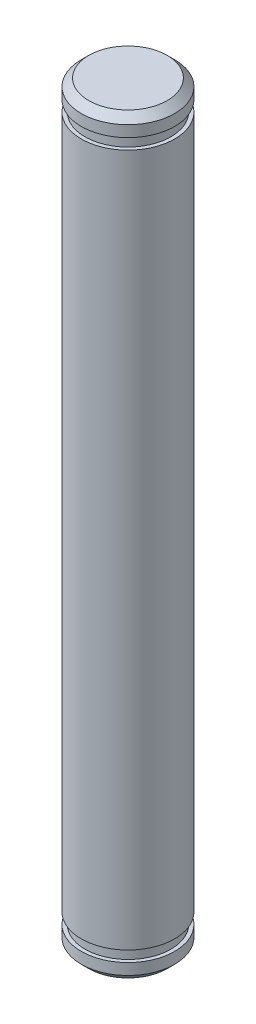
ISO-10303-21;
HEADER;
FILE_DESCRIPTION(('STEP AP214'),'2;1');
FILE_NAME('part.step','',(''),(''),'','','');
FILE_SCHEMA(('AUTOMOTIVE_DESIGN { 1 0 10303 214 1 1 1 1 }'));
ENDSEC;
DATA;
#1=APPLICATION_CONTEXT('core data for automotive mechanical design processes');
#2=APPLICATION_PROTOCOL_DEFINITION('international standard','automotive_design',2000,#1);
#3=PRODUCT_CONTEXT('',#1,'mechanical');
#4=PRODUCT('Part','Part','',(#3));
#5=PRODUCT_RELATED_PRODUCT_CATEGORY('part','',(#4));
#6=PRODUCT_DEFINITION_FORMATION('','',#4);
#7=PRODUCT_DEFINITION_CONTEXT('part definition',#1,'design');
#8=PRODUCT_DEFINITION('design','',#6,#7);
#9=PRODUCT_DEFINITION_SHAPE('','',#8);
#10=(LENGTH_UNIT() NAMED_UNIT(*) SI_UNIT(.MILLI.,.METRE.));
#11=(NAMED_UNIT(*) PLANE_ANGLE_UNIT() SI_UNIT($,.RADIAN.));
#12=(NAMED_UNIT(*) SI_UNIT($,.STERADIAN.) SOLID_ANGLE_UNIT());
#13=UNCERTAINTY_MEASURE_WITH_UNIT(LENGTH_MEASURE(1.E-05),#10,'distance_accuracy_value','');
#14=(GEOMETRIC_REPRESENTATION_CONTEXT(3) GLOBAL_UNCERTAINTY_ASSIGNED_CONTEXT((#13)) GLOBAL_UNIT_ASSIGNED_CONTEXT((#10,
#11,#12)) REPRESENTATION_CONTEXT('',''));
#15=CARTESIAN_POINT('',(0.,0.,0.));
#16=DIRECTION('',(0.,0.,1.));
#17=DIRECTION('',(1.,0.,0.));
#18=AXIS2_PLACEMENT_3D('',#15,#16,#17);
#19=CARTESIAN_POINT('',(0.,-25.5651,0.));
#20=DIRECTION('',(0.,-1.,0.));
#21=DIRECTION('',(1.,0.,0.));
#22=AXIS2_PLACEMENT_3D('',#19,#20,#21);
#23=PLANE('',#22);
#24=CARTESIAN_POINT('',(0.,-25.5651,0.));
#25=DIRECTION('',(0.,-1.,0.));
#26=DIRECTION('',(1.,0.,0.));
#27=AXIS2_PLACEMENT_3D('',#24,#25,#26);
#28=CIRCLE('',#27,2.66699999999997);
#29=CARTESIAN_POINT('',(2.66699999999995,-25.5651,0.));
#30=VERTEX_POINT('',#29);
#31=EDGE_CURVE('E56',#30,#30,#28,.T.);
#32=ORIENTED_EDGE('',*,*,#31,.T.);
#33=EDGE_LOOP('',(#32));
#34=FACE_BOUND('',#33,.T.);
#35=ADVANCED_FACE('F45',(#34),#23,.T.);
#36=CARTESIAN_POINT('',(0.,25.5651,0.));
#37=DIRECTION('',(0.,1.,0.));
#38=DIRECTION('',(-1.,0.,0.));
#39=AXIS2_PLACEMENT_3D('',#36,#37,#38);
#40=CYLINDRICAL_SURFACE('',#39,3.17499999999997);
#41=CARTESIAN_POINT('',(0.,-25.0571,0.));
#42=DIRECTION('',(0.,-1.,0.));
#43=DIRECTION('',(1.,0.,0.));
#44=AXIS2_PLACEMENT_3D('',#41,#42,#43);
#45=CIRCLE('',#44,3.17499999999997);
#46=CARTESIAN_POINT('',(3.17499999999995,-25.0571,0.));
#47=VERTEX_POINT('',#46);
#48=EDGE_CURVE('E60',#47,#47,#45,.F.);
#49=ORIENTED_EDGE('',*,*,#48,.T.);
#50=EDGE_LOOP('',(#49));
#51=FACE_BOUND('',#50,.T.);
#52=CARTESIAN_POINT('',(0.,-24.2951,0.));
#53=DIRECTION('',(0.,1.,0.));
#54=DIRECTION('',(-1.,0.,0.));
#55=AXIS2_PLACEMENT_3D('',#52,#53,#54);
#56=CIRCLE('',#55,3.17499999999997);
#57=CARTESIAN_POINT('',(-3.17499999999999,-24.2951,0.));
#58=VERTEX_POINT('',#57);
#59=EDGE_CURVE('E65',#58,#58,#56,.T.);
#60=ORIENTED_EDGE('',*,*,#59,.F.);
#61=EDGE_LOOP('',(#60));
#62=FACE_BOUND('',#61,.T.);
#63=ADVANCED_FACE('F107',(#51,#62),#40,.T.);
#64=CARTESIAN_POINT('',(-3.17499999999999,-24.2951,0.));
#65=DIRECTION('',(0.,1.,0.));
#66=DIRECTION('',(-1.,0.,0.));
#67=AXIS2_PLACEMENT_3D('',#64,#65,#66);
#68=PLANE('',#67);
#69=ORIENTED_EDGE('',*,*,#59,.T.);
#70=EDGE_LOOP('',(#69));
#71=FACE_BOUND('',#70,.T.);
#72=CARTESIAN_POINT('',(0.,-24.2951,0.));
#73=DIRECTION('',(0.,1.,0.));
#74=DIRECTION('',(-1.,0.,0.));
#75=AXIS2_PLACEMENT_3D('',#72,#73,#74);
#76=CIRCLE('',#75,2.92099999999997);
#77=CARTESIAN_POINT('',(-2.92099999999999,-24.2951,0.));
#78=VERTEX_POINT('',#77);
#79=EDGE_CURVE('E68',#78,#78,#76,.T.);
#80=ORIENTED_EDGE('',*,*,#79,.F.);
#81=EDGE_LOOP('',(#80));
#82=FACE_BOUND('',#81,.T.);
#83=ADVANCED_FACE('F113',(#71,#82),#68,.T.);
#84=CARTESIAN_POINT('',(0.,25.5651,0.));
#85=DIRECTION('',(0.,1.,0.));
#86=DIRECTION('',(-1.,0.,0.));
#87=AXIS2_PLACEMENT_3D('',#84,#85,#86);
#88=CYLINDRICAL_SURFACE('',#87,2.92099999999997);
#89=ORIENTED_EDGE('',*,*,#79,.T.);
#90=EDGE_LOOP('',(#89));
#91=FACE_BOUND('',#90,.T.);
#92=CARTESIAN_POINT('',(0.,-23.5585,0.));
#93=DIRECTION('',(0.,1.,0.));
#94=DIRECTION('',(-1.,0.,0.));
#95=AXIS2_PLACEMENT_3D('',#92,#93,#94);
#96=CIRCLE('',#95,2.92099999999997);
#97=CARTESIAN_POINT('',(-2.92099999999999,-23.5585,0.));
#98=VERTEX_POINT('',#97);
#99=EDGE_CURVE('E71',#98,#98,#96,.T.);
#100=ORIENTED_EDGE('',*,*,#99,.F.);
#101=EDGE_LOOP('',(#100));
#102=FACE_BOUND('',#101,.T.);
#103=ADVANCED_FACE('F134',(#91,#102),#88,.T.);
#104=CARTESIAN_POINT('',(-3.175,-23.5585,0.));
#105=DIRECTION('',(0.,-1.,0.));
#106=DIRECTION('',(1.,0.,0.));
#107=AXIS2_PLACEMENT_3D('',#104,#105,#106);
#108=PLANE('',#107);
#109=ORIENTED_EDGE('',*,*,#99,.T.);
#110=EDGE_LOOP('',(#109));
#111=FACE_BOUND('',#110,.T.);
#112=CARTESIAN_POINT('',(0.,-23.5585,0.));
#113=DIRECTION('',(0.,1.,0.));
#114=DIRECTION('',(-1.,0.,0.));
#115=AXIS2_PLACEMENT_3D('',#112,#113,#114);
#116=CIRCLE('',#115,3.17499999999998);
#117=CARTESIAN_POINT('',(-3.175,-23.5585,0.));
#118=VERTEX_POINT('',#117);
#119=EDGE_CURVE('E74',#118,#118,#116,.T.);
#120=ORIENTED_EDGE('',*,*,#119,.F.);
#121=EDGE_LOOP('',(#120));
#122=FACE_BOUND('',#121,.T.);
#123=ADVANCED_FACE('F139',(#111,#122),#108,.T.);
#124=CARTESIAN_POINT('',(0.,25.5651,0.));
#125=DIRECTION('',(0.,1.,0.));
#126=DIRECTION('',(-1.,0.,0.));
#127=AXIS2_PLACEMENT_3D('',#124,#125,#126);
#128=CYLINDRICAL_SURFACE('',#127,3.17499999999999);
#129=ORIENTED_EDGE('',*,*,#119,.T.);
#130=EDGE_LOOP('',(#129));
#131=FACE_BOUND('',#130,.T.);
#132=CARTESIAN_POINT('',(0.,23.5585,0.));
#133=DIRECTION('',(0.,1.,0.));
#134=DIRECTION('',(-1.,0.,0.));
#135=AXIS2_PLACEMENT_3D('',#132,#133,#134);
#136=CIRCLE('',#135,3.175);
#137=CARTESIAN_POINT('',(-3.175,23.5585,0.));
#138=VERTEX_POINT('',#137);
#139=EDGE_CURVE('E77',#138,#138,#136,.T.);
#140=ORIENTED_EDGE('',*,*,#139,.F.);
#141=EDGE_LOOP('',(#140));
#142=FACE_BOUND('',#141,.T.);
#143=ADVANCED_FACE('F145',(#131,#142),#128,.T.);
#144=CARTESIAN_POINT('',(-3.175,23.5585,0.));
#145=DIRECTION('',(0.,1.,0.));
#146=DIRECTION('',(-1.,0.,0.));
#147=AXIS2_PLACEMENT_3D('',#144,#145,#146);
#148=PLANE('',#147);
#149=ORIENTED_EDGE('',*,*,#139,.T.);
#150=EDGE_LOOP('',(#149));
#151=FACE_BOUND('',#150,.T.);
#152=CARTESIAN_POINT('',(0.,23.5585,0.));
#153=DIRECTION('',(0.,1.,0.));
#154=DIRECTION('',(-1.,0.,0.));
#155=AXIS2_PLACEMENT_3D('',#152,#153,#154);
#156=CIRCLE('',#155,2.921);
#157=CARTESIAN_POINT('',(-2.92099999999999,23.5585,0.));
#158=VERTEX_POINT('',#157);
#159=EDGE_CURVE('E80',#158,#158,#156,.T.);
#160=ORIENTED_EDGE('',*,*,#159,.F.);
#161=EDGE_LOOP('',(#160));
#162=FACE_BOUND('',#161,.T.);
#163=ADVANCED_FACE('F103',(#151,#162),#148,.T.);
#164=CARTESIAN_POINT('',(0.,25.5651,0.));
#165=DIRECTION('',(0.,1.,0.));
#166=DIRECTION('',(-1.,0.,0.));
#167=AXIS2_PLACEMENT_3D('',#164,#165,#166);
#168=CYLINDRICAL_SURFACE('',#167,2.921);
#169=ORIENTED_EDGE('',*,*,#159,.T.);
#170=EDGE_LOOP('',(#169));
#171=FACE_BOUND('',#170,.T.);
#172=CARTESIAN_POINT('',(0.,24.2951,0.));
#173=DIRECTION('',(0.,1.,0.));
#174=DIRECTION('',(-1.,0.,0.));
#175=AXIS2_PLACEMENT_3D('',#172,#173,#174);
#176=CIRCLE('',#175,2.921);
#177=CARTESIAN_POINT('',(-2.92099999999999,24.2951,0.));
#178=VERTEX_POINT('',#177);
#179=EDGE_CURVE('E83',#178,#178,#176,.T.);
#180=ORIENTED_EDGE('',*,*,#179,.F.);
#181=EDGE_LOOP('',(#180));
#182=FACE_BOUND('',#181,.T.);
#183=ADVANCED_FACE('F94',(#171,#182),#168,.T.);
#184=CARTESIAN_POINT('',(-3.17499999999999,24.2951,0.));
#185=DIRECTION('',(0.,-1.,0.));
#186=DIRECTION('',(1.,0.,0.));
#187=AXIS2_PLACEMENT_3D('',#184,#185,#186);
#188=PLANE('',#187);
#189=ORIENTED_EDGE('',*,*,#179,.T.);
#190=EDGE_LOOP('',(#189));
#191=FACE_BOUND('',#190,.T.);
#192=CARTESIAN_POINT('',(0.,24.2951,0.));
#193=DIRECTION('',(0.,1.,0.));
#194=DIRECTION('',(-1.,0.,0.));
#195=AXIS2_PLACEMENT_3D('',#192,#193,#194);
#196=CIRCLE('',#195,3.175);
#197=CARTESIAN_POINT('',(-3.17499999999999,24.2951,0.));
#198=VERTEX_POINT('',#197);
#199=EDGE_CURVE('E86',#198,#198,#196,.T.);
#200=ORIENTED_EDGE('',*,*,#199,.F.);
#201=EDGE_LOOP('',(#200));
#202=FACE_BOUND('',#201,.T.);
#203=ADVANCED_FACE('F92',(#191,#202),#188,.T.);
#204=CARTESIAN_POINT('',(0.,25.5651,0.));
#205=DIRECTION('',(0.,1.,0.));
#206=DIRECTION('',(-1.,0.,0.));
#207=AXIS2_PLACEMENT_3D('',#204,#205,#206);
#208=CYLINDRICAL_SURFACE('',#207,3.175);
#209=CARTESIAN_POINT('',(0.,25.0571,0.));
#210=DIRECTION('',(0.,1.,0.));
#211=DIRECTION('',(-1.,0.,0.));
#212=AXIS2_PLACEMENT_3D('',#209,#210,#211);
#213=CIRCLE('',#212,3.175);
#214=CARTESIAN_POINT('',(-3.17499999999999,25.0571,0.));
#215=VERTEX_POINT('',#214);
#216=EDGE_CURVE('E12',#215,#215,#213,.F.);
#217=ORIENTED_EDGE('',*,*,#216,.T.);
#218=EDGE_LOOP('',(#217));
#219=FACE_BOUND('',#218,.T.);
#220=ORIENTED_EDGE('',*,*,#199,.T.);
#221=EDGE_LOOP('',(#220));
#222=FACE_BOUND('',#221,.T.);
#223=ADVANCED_FACE('F90',(#219,#222),#208,.T.);
#224=CARTESIAN_POINT('',(0.,25.5651,0.));
#225=DIRECTION('',(0.,1.,0.));
#226=DIRECTION('',(-1.,0.,0.));
#227=AXIS2_PLACEMENT_3D('',#224,#225,#226);
#228=PLANE('',#227);
#229=CARTESIAN_POINT('',(0.,25.5651,0.));
#230=DIRECTION('',(0.,1.,0.));
#231=DIRECTION('',(-1.,0.,0.));
#232=AXIS2_PLACEMENT_3D('',#229,#230,#231);
#233=CIRCLE('',#232,2.667);
#234=CARTESIAN_POINT('',(-2.66699999999999,25.5651,0.));
#235=VERTEX_POINT('',#234);
#236=EDGE_CURVE('E52',#235,#235,#233,.T.);
#237=ORIENTED_EDGE('',*,*,#236,.T.);
#238=EDGE_LOOP('',(#237));
#239=FACE_BOUND('',#238,.T.);
#240=ADVANCED_FACE('F101',(#239),#228,.T.);
#241=CARTESIAN_POINT('',(0.,-25.0571,0.));
#242=DIRECTION('',(0.,1.,0.));
#243=DIRECTION('',(-1.,0.,0.));
#244=AXIS2_PLACEMENT_3D('',#241,#242,#243);
#245=CONICAL_SURFACE('',#244,3.17499999999997,0.785398163397455);
#246=ORIENTED_EDGE('',*,*,#31,.F.);
#247=EDGE_LOOP('',(#246));
#248=FACE_BOUND('',#247,.T.);
#249=ORIENTED_EDGE('',*,*,#48,.F.);
#250=EDGE_LOOP('',(#249));
#251=FACE_BOUND('',#250,.T.);
#252=ADVANCED_FACE('F117',(#248,#251),#245,.T.);
#253=CARTESIAN_POINT('',(0.,25.5651,0.));
#254=DIRECTION('',(0.,-1.,0.));
#255=DIRECTION('',(1.,0.,0.));
#256=AXIS2_PLACEMENT_3D('',#253,#254,#255);
#257=CONICAL_SURFACE('',#256,2.667,0.785398163397444);
#258=ORIENTED_EDGE('',*,*,#216,.F.);
#259=EDGE_LOOP('',(#258));
#260=FACE_BOUND('',#259,.T.);
#261=ORIENTED_EDGE('',*,*,#236,.F.);
#262=EDGE_LOOP('',(#261));
#263=FACE_BOUND('',#262,.T.);
#264=ADVANCED_FACE('F47',(#260,#263),#257,.T.);
#265=CLOSED_SHELL('',(#35,#63,#83,#103,#123,#143,#163,#183,#203,#223,#240,#252,#264));
#266=MANIFOLD_SOLID_BREP('B2',#265);
#267=ADVANCED_BREP_SHAPE_REPRESENTATION('',(#18,#266),#14);
#268=SHAPE_DEFINITION_REPRESENTATION(#9,#267);
ENDSEC;
END-ISO-10303-21;
